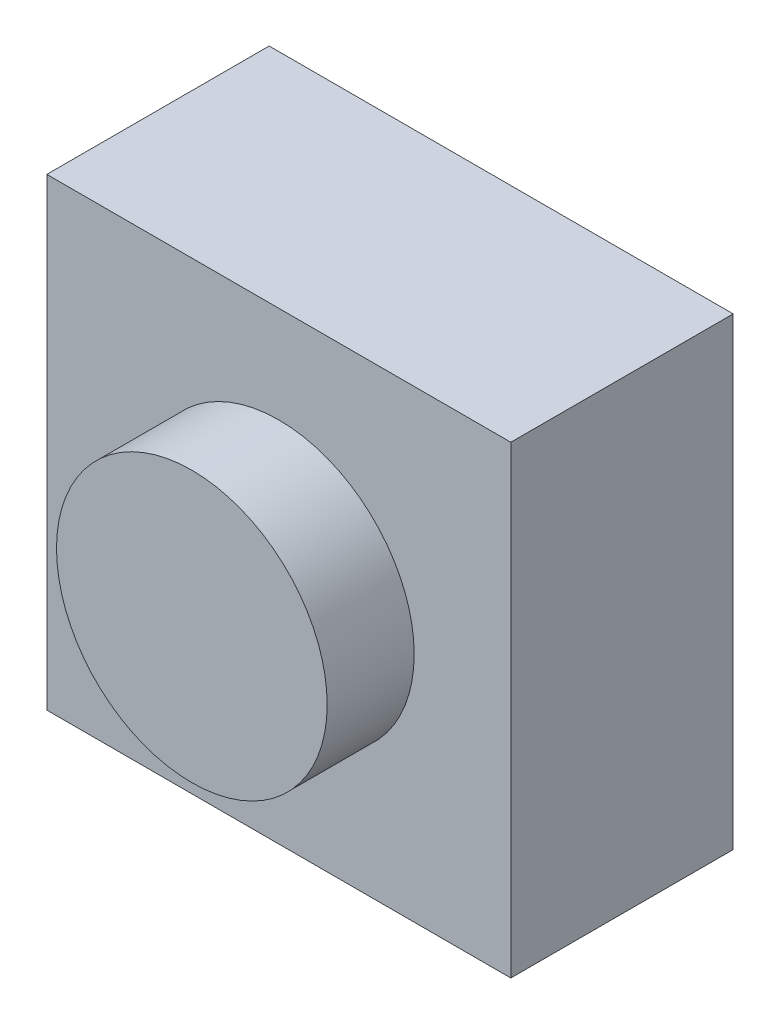
ISO-10303-21;
HEADER;
FILE_DESCRIPTION(('STEP AP214'),'2;1');
FILE_NAME('part.step','',(''),(''),'','','');
FILE_SCHEMA(('AUTOMOTIVE_DESIGN { 1 0 10303 214 1 1 1 1 }'));
ENDSEC;
DATA;
#1=APPLICATION_CONTEXT('core data for automotive mechanical design processes');
#2=APPLICATION_PROTOCOL_DEFINITION('international standard','automotive_design',2000,#1);
#3=PRODUCT_CONTEXT('',#1,'mechanical');
#4=PRODUCT('Part','Part','',(#3));
#5=PRODUCT_RELATED_PRODUCT_CATEGORY('part','',(#4));
#6=PRODUCT_DEFINITION_FORMATION('','',#4);
#7=PRODUCT_DEFINITION_CONTEXT('part definition',#1,'design');
#8=PRODUCT_DEFINITION('design','',#6,#7);
#9=PRODUCT_DEFINITION_SHAPE('','',#8);
#10=(LENGTH_UNIT() NAMED_UNIT(*) SI_UNIT(.MILLI.,.METRE.));
#11=(NAMED_UNIT(*) PLANE_ANGLE_UNIT() SI_UNIT($,.RADIAN.));
#12=(NAMED_UNIT(*) SI_UNIT($,.STERADIAN.) SOLID_ANGLE_UNIT());
#13=UNCERTAINTY_MEASURE_WITH_UNIT(LENGTH_MEASURE(1.E-05),#10,'distance_accuracy_value','');
#14=(GEOMETRIC_REPRESENTATION_CONTEXT(3) GLOBAL_UNCERTAINTY_ASSIGNED_CONTEXT((#13)) GLOBAL_UNIT_ASSIGNED_CONTEXT((#10,
#11,#12)) REPRESENTATION_CONTEXT('',''));
#15=CARTESIAN_POINT('',(0.,0.,0.));
#16=DIRECTION('',(0.,0.,1.));
#17=DIRECTION('',(1.,0.,0.));
#18=AXIS2_PLACEMENT_3D('',#15,#16,#17);
#19=CARTESIAN_POINT('',(-143.902802819766,76.8810908463274,2.921));
#20=DIRECTION('',(0.,0.,1.));
#21=DIRECTION('',(1.,0.,0.));
#22=AXIS2_PLACEMENT_3D('',#19,#20,#21);
#23=PLANE('',#22);
#24=DIRECTION('',(0.,1.,0.));
#25=VECTOR('',#24,1.);
#26=CARTESIAN_POINT('',(-143.902802819766,82.9770908463274,2.921));
#27=LINE('',#26,#25);
#28=CARTESIAN_POINT('',(-143.902802819766,76.8810908463274,2.921));
#29=VERTEX_POINT('',#28);
#30=CARTESIAN_POINT('',(-143.902802819766,82.9770908463274,2.921));
#31=VERTEX_POINT('',#30);
#32=EDGE_CURVE('E87',#29,#31,#27,.T.);
#33=ORIENTED_EDGE('',*,*,#32,.T.);
#34=DIRECTION('',(-1.,0.,0.));
#35=VECTOR('',#34,1.);
#36=CARTESIAN_POINT('',(-149.998802819766,82.9770908463274,2.921));
#37=LINE('',#36,#35);
#38=CARTESIAN_POINT('',(-149.998802819766,82.9770908463274,2.921));
#39=VERTEX_POINT('',#38);
#40=EDGE_CURVE('E82',#31,#39,#37,.T.);
#41=ORIENTED_EDGE('',*,*,#40,.T.);
#42=DIRECTION('',(0.,-1.,0.));
#43=VECTOR('',#42,1.);
#44=CARTESIAN_POINT('',(-149.998802819766,82.9770908463274,2.921));
#45=LINE('',#44,#43);
#46=CARTESIAN_POINT('',(-149.998802819766,76.8810908463274,2.921));
#47=VERTEX_POINT('',#46);
#48=EDGE_CURVE('E85',#39,#47,#45,.T.);
#49=ORIENTED_EDGE('',*,*,#48,.T.);
#50=DIRECTION('',(1.,0.,0.));
#51=VECTOR('',#50,1.);
#52=CARTESIAN_POINT('',(-149.998802819766,76.8810908463274,2.921));
#53=LINE('',#52,#51);
#54=EDGE_CURVE('E52',#47,#29,#53,.T.);
#55=ORIENTED_EDGE('',*,*,#54,.T.);
#56=EDGE_LOOP('',(#33,#41,#49,#55));
#57=FACE_BOUND('',#56,.T.);
#58=CARTESIAN_POINT('',(-146.950802819766,79.9290908463274,2.921));
#59=DIRECTION('',(0.,0.,1.));
#60=DIRECTION('',(1.,0.,0.));
#61=AXIS2_PLACEMENT_3D('',#58,#59,#60);
#62=CIRCLE('',#61,1.778);
#63=CARTESIAN_POINT('',(-145.172802819766,79.9290908463274,2.921));
#64=VERTEX_POINT('',#63);
#65=EDGE_CURVE('E113',#64,#64,#62,.T.);
#66=ORIENTED_EDGE('',*,*,#65,.F.);
#67=EDGE_LOOP('',(#66));
#68=FACE_BOUND('',#67,.T.);
#69=ADVANCED_FACE('F35',(#57,#68),#23,.T.);
#70=CARTESIAN_POINT('',(-143.902802819766,82.9770908463274,2.921));
#71=DIRECTION('',(-1.,0.,0.));
#72=DIRECTION('',(0.,0.,1.));
#73=AXIS2_PLACEMENT_3D('',#70,#71,#72);
#74=PLANE('',#73);
#75=DIRECTION('',(0.,1.,0.));
#76=VECTOR('',#75,1.);
#77=CARTESIAN_POINT('',(-143.902802819766,82.9770908463274,0.));
#78=LINE('',#77,#76);
#79=CARTESIAN_POINT('',(-143.902802819766,76.8810908463274,0.));
#80=VERTEX_POINT('',#79);
#81=CARTESIAN_POINT('',(-143.902802819766,82.9770908463274,0.));
#82=VERTEX_POINT('',#81);
#83=EDGE_CURVE('E99',#80,#82,#78,.T.);
#84=ORIENTED_EDGE('',*,*,#83,.T.);
#85=DIRECTION('',(0.,0.,-1.));
#86=VECTOR('',#85,1.);
#87=CARTESIAN_POINT('',(-143.902802819766,82.9770908463274,2.921));
#88=LINE('',#87,#86);
#89=EDGE_CURVE('E11',#31,#82,#88,.T.);
#90=ORIENTED_EDGE('',*,*,#89,.F.);
#91=ORIENTED_EDGE('',*,*,#32,.F.);
#92=DIRECTION('',(0.,0.,-1.));
#93=VECTOR('',#92,1.);
#94=CARTESIAN_POINT('',(-143.902802819766,76.8810908463274,2.921));
#95=LINE('',#94,#93);
#96=EDGE_CURVE('E95',#29,#80,#95,.T.);
#97=ORIENTED_EDGE('',*,*,#96,.T.);
#98=EDGE_LOOP('',(#84,#90,#91,#97));
#99=FACE_BOUND('',#98,.T.);
#100=ADVANCED_FACE('F37',(#99),#74,.F.);
#101=CARTESIAN_POINT('',(-149.998802819766,82.9770908463274,2.921));
#102=DIRECTION('',(0.,-1.,0.));
#103=DIRECTION('',(0.,0.,-1.));
#104=AXIS2_PLACEMENT_3D('',#101,#102,#103);
#105=PLANE('',#104);
#106=DIRECTION('',(-1.,0.,0.));
#107=VECTOR('',#106,1.);
#108=CARTESIAN_POINT('',(-149.998802819766,82.9770908463274,0.));
#109=LINE('',#108,#107);
#110=CARTESIAN_POINT('',(-149.998802819766,82.9770908463274,0.));
#111=VERTEX_POINT('',#110);
#112=EDGE_CURVE('E91',#82,#111,#109,.T.);
#113=ORIENTED_EDGE('',*,*,#112,.T.);
#114=DIRECTION('',(0.,0.,-1.));
#115=VECTOR('',#114,1.);
#116=CARTESIAN_POINT('',(-149.998802819766,82.9770908463274,2.921));
#117=LINE('',#116,#115);
#118=EDGE_CURVE('E44',#39,#111,#117,.T.);
#119=ORIENTED_EDGE('',*,*,#118,.F.);
#120=ORIENTED_EDGE('',*,*,#40,.F.);
#121=ORIENTED_EDGE('',*,*,#89,.T.);
#122=EDGE_LOOP('',(#113,#119,#120,#121));
#123=FACE_BOUND('',#122,.T.);
#124=ADVANCED_FACE('F90',(#123),#105,.F.);
#125=CARTESIAN_POINT('',(-149.998802819766,82.9770908463274,2.921));
#126=DIRECTION('',(1.,0.,0.));
#127=DIRECTION('',(0.,0.,-1.));
#128=AXIS2_PLACEMENT_3D('',#125,#126,#127);
#129=PLANE('',#128);
#130=DIRECTION('',(0.,-1.,0.));
#131=VECTOR('',#130,1.);
#132=CARTESIAN_POINT('',(-149.998802819766,82.9770908463274,0.));
#133=LINE('',#132,#131);
#134=CARTESIAN_POINT('',(-149.998802819766,76.8810908463274,0.));
#135=VERTEX_POINT('',#134);
#136=EDGE_CURVE('E69',#111,#135,#133,.T.);
#137=ORIENTED_EDGE('',*,*,#136,.T.);
#138=DIRECTION('',(0.,0.,-1.));
#139=VECTOR('',#138,1.);
#140=CARTESIAN_POINT('',(-149.998802819766,76.8810908463274,2.921));
#141=LINE('',#140,#139);
#142=EDGE_CURVE('E92',#47,#135,#141,.T.);
#143=ORIENTED_EDGE('',*,*,#142,.F.);
#144=ORIENTED_EDGE('',*,*,#48,.F.);
#145=ORIENTED_EDGE('',*,*,#118,.T.);
#146=EDGE_LOOP('',(#137,#143,#144,#145));
#147=FACE_BOUND('',#146,.T.);
#148=ADVANCED_FACE('F93',(#147),#129,.F.);
#149=CARTESIAN_POINT('',(-149.998802819766,76.8810908463274,2.921));
#150=DIRECTION('',(0.,1.,0.));
#151=DIRECTION('',(0.,0.,1.));
#152=AXIS2_PLACEMENT_3D('',#149,#150,#151);
#153=PLANE('',#152);
#154=DIRECTION('',(1.,0.,0.));
#155=VECTOR('',#154,1.);
#156=CARTESIAN_POINT('',(-149.998802819766,76.8810908463274,0.));
#157=LINE('',#156,#155);
#158=EDGE_CURVE('E75',#135,#80,#157,.T.);
#159=ORIENTED_EDGE('',*,*,#158,.T.);
#160=ORIENTED_EDGE('',*,*,#96,.F.);
#161=ORIENTED_EDGE('',*,*,#54,.F.);
#162=ORIENTED_EDGE('',*,*,#142,.T.);
#163=EDGE_LOOP('',(#159,#160,#161,#162));
#164=FACE_BOUND('',#163,.T.);
#165=ADVANCED_FACE('F107',(#164),#153,.F.);
#166=CARTESIAN_POINT('',(-143.902802819766,76.8810908463274,0.));
#167=DIRECTION('',(0.,0.,1.));
#168=DIRECTION('',(1.,0.,0.));
#169=AXIS2_PLACEMENT_3D('',#166,#167,#168);
#170=PLANE('',#169);
#171=ORIENTED_EDGE('',*,*,#83,.F.);
#172=ORIENTED_EDGE('',*,*,#158,.F.);
#173=ORIENTED_EDGE('',*,*,#136,.F.);
#174=ORIENTED_EDGE('',*,*,#112,.F.);
#175=EDGE_LOOP('',(#171,#172,#173,#174));
#176=FACE_BOUND('',#175,.T.);
#177=ADVANCED_FACE('F110',(#176),#170,.F.);
#178=CARTESIAN_POINT('',(-146.950802819766,79.9290908463274,4.064));
#179=DIRECTION('',(0.,0.,-1.));
#180=DIRECTION('',(-1.,0.,0.));
#181=AXIS2_PLACEMENT_3D('',#178,#179,#180);
#182=CYLINDRICAL_SURFACE('',#181,1.778);
#183=CARTESIAN_POINT('',(-146.950802819766,79.9290908463274,4.064));
#184=DIRECTION('',(0.,0.,1.));
#185=DIRECTION('',(1.,0.,0.));
#186=AXIS2_PLACEMENT_3D('',#183,#184,#185);
#187=CIRCLE('',#186,1.778);
#188=CARTESIAN_POINT('',(-145.172802819766,79.9290908463274,4.064));
#189=VERTEX_POINT('',#188);
#190=EDGE_CURVE('E102',#189,#189,#187,.T.);
#191=ORIENTED_EDGE('',*,*,#190,.F.);
#192=EDGE_LOOP('',(#191));
#193=FACE_BOUND('',#192,.T.);
#194=ORIENTED_EDGE('',*,*,#65,.T.);
#195=EDGE_LOOP('',(#194));
#196=FACE_BOUND('',#195,.T.);
#197=ADVANCED_FACE('F121',(#193,#196),#182,.T.);
#198=CARTESIAN_POINT('',(-146.950802819766,79.9290908463274,4.064));
#199=DIRECTION('',(0.,0.,1.));
#200=DIRECTION('',(1.,0.,0.));
#201=AXIS2_PLACEMENT_3D('',#198,#199,#200);
#202=PLANE('',#201);
#203=ORIENTED_EDGE('',*,*,#190,.T.);
#204=EDGE_LOOP('',(#203));
#205=FACE_BOUND('',#204,.T.);
#206=ADVANCED_FACE('F119',(#205),#202,.T.);
#207=CLOSED_SHELL('',(#69,#100,#124,#148,#165,#177,#197,#206));
#208=MANIFOLD_SOLID_BREP('B2',#207);
#209=ADVANCED_BREP_SHAPE_REPRESENTATION('',(#18,#208),#14);
#210=SHAPE_DEFINITION_REPRESENTATION(#9,#209);
ENDSEC;
END-ISO-10303-21;
